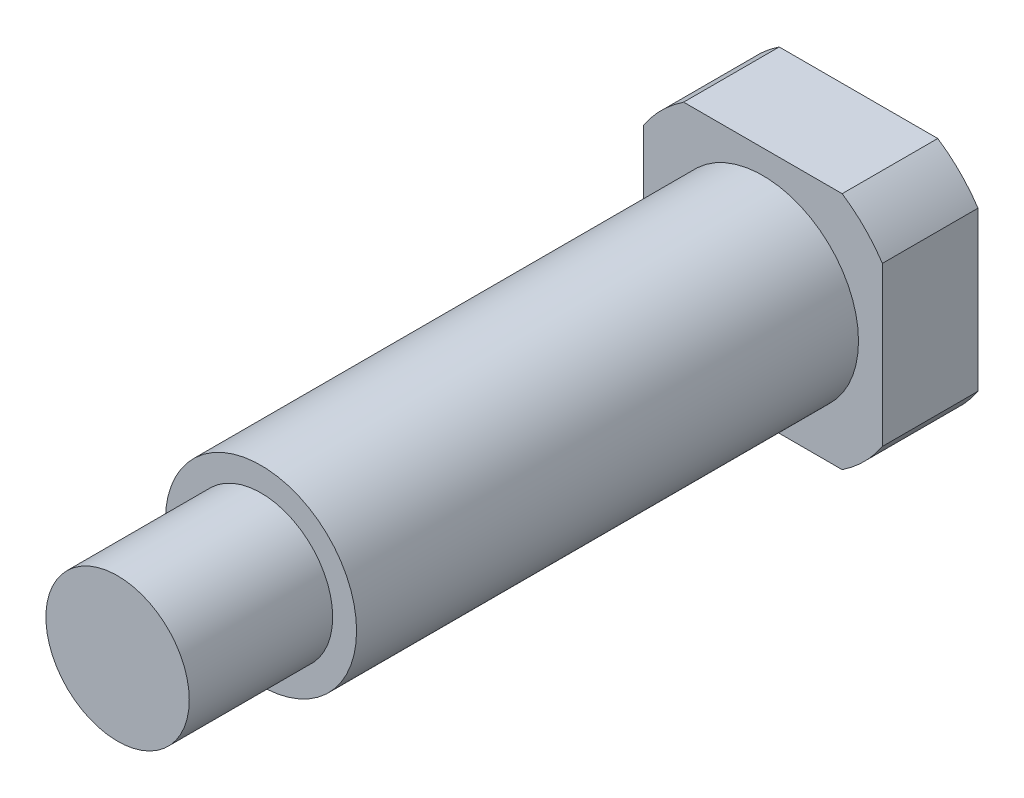
ISO-10303-21;
HEADER;
FILE_DESCRIPTION(('STEP AP214'),'2;1');
FILE_NAME('part.step','',(''),(''),'','','');
FILE_SCHEMA(('AUTOMOTIVE_DESIGN { 1 0 10303 214 1 1 1 1 }'));
ENDSEC;
DATA;
#1=APPLICATION_CONTEXT('core data for automotive mechanical design processes');
#2=APPLICATION_PROTOCOL_DEFINITION('international standard','automotive_design',2000,#1);
#3=PRODUCT_CONTEXT('',#1,'mechanical');
#4=PRODUCT('Part','Part','',(#3));
#5=PRODUCT_RELATED_PRODUCT_CATEGORY('part','',(#4));
#6=PRODUCT_DEFINITION_FORMATION('','',#4);
#7=PRODUCT_DEFINITION_CONTEXT('part definition',#1,'design');
#8=PRODUCT_DEFINITION('design','',#6,#7);
#9=PRODUCT_DEFINITION_SHAPE('','',#8);
#10=(LENGTH_UNIT() NAMED_UNIT(*) SI_UNIT(.MILLI.,.METRE.));
#11=(NAMED_UNIT(*) PLANE_ANGLE_UNIT() SI_UNIT($,.RADIAN.));
#12=(NAMED_UNIT(*) SI_UNIT($,.STERADIAN.) SOLID_ANGLE_UNIT());
#13=UNCERTAINTY_MEASURE_WITH_UNIT(LENGTH_MEASURE(1.E-05),#10,'distance_accuracy_value','');
#14=(GEOMETRIC_REPRESENTATION_CONTEXT(3) GLOBAL_UNCERTAINTY_ASSIGNED_CONTEXT((#13)) GLOBAL_UNIT_ASSIGNED_CONTEXT((#10,
#11,#12)) REPRESENTATION_CONTEXT('',''));
#15=CARTESIAN_POINT('',(0.,0.,0.));
#16=DIRECTION('',(0.,0.,1.));
#17=DIRECTION('',(1.,0.,0.));
#18=AXIS2_PLACEMENT_3D('',#15,#16,#17);
#19=CARTESIAN_POINT('',(0.,0.,4.));
#20=DIRECTION('',(0.,0.,1.));
#21=DIRECTION('',(1.,0.,0.));
#22=AXIS2_PLACEMENT_3D('',#19,#20,#21);
#23=PLANE('',#22);
#24=CARTESIAN_POINT('',(0.,0.,4.));
#25=DIRECTION('',(0.,0.,1.));
#26=DIRECTION('',(1.,0.,0.));
#27=AXIS2_PLACEMENT_3D('',#24,#25,#26);
#28=CIRCLE('',#27,4.);
#29=CARTESIAN_POINT('',(4.,0.,4.));
#30=VERTEX_POINT('',#29);
#31=EDGE_CURVE('E126',#30,#30,#28,.T.);
#32=ORIENTED_EDGE('',*,*,#31,.F.);
#33=EDGE_LOOP('',(#32));
#34=FACE_BOUND('',#33,.T.);
#35=CARTESIAN_POINT('',(0.,0.,4.));
#36=DIRECTION('',(0.,0.,1.));
#37=DIRECTION('',(1.,0.,0.));
#38=AXIS2_PLACEMENT_3D('',#35,#36,#37);
#39=CIRCLE('',#38,6.);
#40=CARTESIAN_POINT('',(3.3166247903554,-5.,4.));
#41=VERTEX_POINT('',#40);
#42=CARTESIAN_POINT('',(5.,-3.31662479035539,4.));
#43=VERTEX_POINT('',#42);
#44=EDGE_CURVE('E115',#41,#43,#39,.T.);
#45=ORIENTED_EDGE('',*,*,#44,.T.);
#46=DIRECTION('',(0.,1.,0.));
#47=VECTOR('',#46,1.);
#48=CARTESIAN_POINT('',(5.,0.,4.));
#49=LINE('',#48,#47);
#50=CARTESIAN_POINT('',(5.,3.31662479035539,4.));
#51=VERTEX_POINT('',#50);
#52=EDGE_CURVE('E158',#43,#51,#49,.T.);
#53=ORIENTED_EDGE('',*,*,#52,.T.);
#54=CARTESIAN_POINT('',(3.3166247903554,5.,4.));
#55=VERTEX_POINT('',#54);
#56=EDGE_CURVE('E108',#51,#55,#39,.T.);
#57=ORIENTED_EDGE('',*,*,#56,.T.);
#58=DIRECTION('',(-1.,0.,0.));
#59=VECTOR('',#58,1.);
#60=CARTESIAN_POINT('',(0.,5.,4.));
#61=LINE('',#60,#59);
#62=CARTESIAN_POINT('',(-3.3166247903554,5.,4.));
#63=VERTEX_POINT('',#62);
#64=EDGE_CURVE('E153',#55,#63,#61,.T.);
#65=ORIENTED_EDGE('',*,*,#64,.T.);
#66=CARTESIAN_POINT('',(-5.,3.3166247903554,4.));
#67=VERTEX_POINT('',#66);
#68=EDGE_CURVE('E173',#63,#67,#39,.T.);
#69=ORIENTED_EDGE('',*,*,#68,.T.);
#70=DIRECTION('',(0.,-1.,0.));
#71=VECTOR('',#70,1.);
#72=CARTESIAN_POINT('',(-5.,0.,4.));
#73=LINE('',#72,#71);
#74=CARTESIAN_POINT('',(-5.,-3.3166247903554,4.));
#75=VERTEX_POINT('',#74);
#76=EDGE_CURVE('E178',#67,#75,#73,.T.);
#77=ORIENTED_EDGE('',*,*,#76,.T.);
#78=CARTESIAN_POINT('',(-3.3166247903554,-5.,4.));
#79=VERTEX_POINT('',#78);
#80=EDGE_CURVE('E133',#75,#79,#39,.T.);
#81=ORIENTED_EDGE('',*,*,#80,.T.);
#82=DIRECTION('',(1.,0.,0.));
#83=VECTOR('',#82,1.);
#84=CARTESIAN_POINT('',(0.,-5.,4.));
#85=LINE('',#84,#83);
#86=EDGE_CURVE('E116',#79,#41,#85,.T.);
#87=ORIENTED_EDGE('',*,*,#86,.T.);
#88=EDGE_LOOP('',(#45,#53,#57,#65,#69,#77,#81,#87));
#89=FACE_BOUND('',#88,.T.);
#90=ADVANCED_FACE('F37',(#34,#89),#23,.T.);
#91=CARTESIAN_POINT('',(0.,0.,4.));
#92=DIRECTION('',(0.,0.,-1.));
#93=DIRECTION('',(-1.,0.,0.));
#94=AXIS2_PLACEMENT_3D('',#91,#92,#93);
#95=CYLINDRICAL_SURFACE('',#94,6.);
#96=DIRECTION('',(0.,0.,-1.));
#97=VECTOR('',#96,1.);
#98=CARTESIAN_POINT('',(5.,-3.31662479035539,4.));
#99=LINE('',#98,#97);
#100=CARTESIAN_POINT('',(5.,-3.31662479035539,0.));
#101=VERTEX_POINT('',#100);
#102=EDGE_CURVE('E51',#43,#101,#99,.T.);
#103=ORIENTED_EDGE('',*,*,#102,.F.);
#104=ORIENTED_EDGE('',*,*,#44,.F.);
#105=DIRECTION('',(0.,0.,-1.));
#106=VECTOR('',#105,1.);
#107=CARTESIAN_POINT('',(3.3166247903554,-5.,4.));
#108=LINE('',#107,#106);
#109=CARTESIAN_POINT('',(3.3166247903554,-5.,0.));
#110=VERTEX_POINT('',#109);
#111=EDGE_CURVE('E101',#110,#41,#108,.F.);
#112=ORIENTED_EDGE('',*,*,#111,.F.);
#113=CARTESIAN_POINT('',(0.,0.,0.));
#114=DIRECTION('',(0.,0.,1.));
#115=DIRECTION('',(1.,0.,0.));
#116=AXIS2_PLACEMENT_3D('',#113,#114,#115);
#117=CIRCLE('',#116,6.);
#118=EDGE_CURVE('E113',#110,#101,#117,.T.);
#119=ORIENTED_EDGE('',*,*,#118,.T.);
#120=EDGE_LOOP('',(#103,#104,#112,#119));
#121=FACE_BOUND('',#120,.T.);
#122=ADVANCED_FACE('F39',(#121),#95,.T.);
#123=DIRECTION('',(0.,0.,-1.));
#124=VECTOR('',#123,1.);
#125=CARTESIAN_POINT('',(5.,3.31662479035539,4.));
#126=LINE('',#125,#124);
#127=CARTESIAN_POINT('',(5.,3.31662479035539,0.));
#128=VERTEX_POINT('',#127);
#129=EDGE_CURVE('E156',#128,#51,#126,.F.);
#130=ORIENTED_EDGE('',*,*,#129,.F.);
#131=CARTESIAN_POINT('',(3.3166247903554,5.,0.));
#132=VERTEX_POINT('',#131);
#133=EDGE_CURVE('E123',#128,#132,#117,.T.);
#134=ORIENTED_EDGE('',*,*,#133,.T.);
#135=DIRECTION('',(0.,0.,-1.));
#136=VECTOR('',#135,1.);
#137=CARTESIAN_POINT('',(3.3166247903554,5.,4.));
#138=LINE('',#137,#136);
#139=EDGE_CURVE('E152',#55,#132,#138,.T.);
#140=ORIENTED_EDGE('',*,*,#139,.F.);
#141=ORIENTED_EDGE('',*,*,#56,.F.);
#142=EDGE_LOOP('',(#130,#134,#140,#141));
#143=FACE_BOUND('',#142,.T.);
#144=ADVANCED_FACE('F204',(#143),#95,.T.);
#145=DIRECTION('',(0.,0.,-1.));
#146=VECTOR('',#145,1.);
#147=CARTESIAN_POINT('',(-3.3166247903554,5.,4.));
#148=LINE('',#147,#146);
#149=CARTESIAN_POINT('',(-3.3166247903554,5.,0.));
#150=VERTEX_POINT('',#149);
#151=EDGE_CURVE('E143',#150,#63,#148,.F.);
#152=ORIENTED_EDGE('',*,*,#151,.F.);
#153=CARTESIAN_POINT('',(-5.,3.3166247903554,0.));
#154=VERTEX_POINT('',#153);
#155=EDGE_CURVE('E124',#150,#154,#117,.T.);
#156=ORIENTED_EDGE('',*,*,#155,.T.);
#157=DIRECTION('',(0.,0.,-1.));
#158=VECTOR('',#157,1.);
#159=CARTESIAN_POINT('',(-5.,3.3166247903554,4.));
#160=LINE('',#159,#158);
#161=EDGE_CURVE('E141',#67,#154,#160,.T.);
#162=ORIENTED_EDGE('',*,*,#161,.F.);
#163=ORIENTED_EDGE('',*,*,#68,.F.);
#164=EDGE_LOOP('',(#152,#156,#162,#163));
#165=FACE_BOUND('',#164,.T.);
#166=ADVANCED_FACE('F139',(#165),#95,.T.);
#167=DIRECTION('',(0.,0.,-1.));
#168=VECTOR('',#167,1.);
#169=CARTESIAN_POINT('',(-5.,-3.3166247903554,4.));
#170=LINE('',#169,#168);
#171=CARTESIAN_POINT('',(-5.,-3.3166247903554,0.));
#172=VERTEX_POINT('',#171);
#173=EDGE_CURVE('E181',#172,#75,#170,.F.);
#174=ORIENTED_EDGE('',*,*,#173,.F.);
#175=CARTESIAN_POINT('',(-3.3166247903554,-5.,0.));
#176=VERTEX_POINT('',#175);
#177=EDGE_CURVE('E120',#172,#176,#117,.T.);
#178=ORIENTED_EDGE('',*,*,#177,.T.);
#179=DIRECTION('',(0.,0.,-1.));
#180=VECTOR('',#179,1.);
#181=CARTESIAN_POINT('',(-3.3166247903554,-5.,4.));
#182=LINE('',#181,#180);
#183=EDGE_CURVE('E59',#79,#176,#182,.T.);
#184=ORIENTED_EDGE('',*,*,#183,.F.);
#185=ORIENTED_EDGE('',*,*,#80,.F.);
#186=EDGE_LOOP('',(#174,#178,#184,#185));
#187=FACE_BOUND('',#186,.T.);
#188=ADVANCED_FACE('F180',(#187),#95,.T.);
#189=CARTESIAN_POINT('',(0.,0.,0.));
#190=DIRECTION('',(0.,0.,1.));
#191=DIRECTION('',(1.,0.,0.));
#192=AXIS2_PLACEMENT_3D('',#189,#190,#191);
#193=PLANE('',#192);
#194=DIRECTION('',(0.,1.,0.));
#195=VECTOR('',#194,1.);
#196=CARTESIAN_POINT('',(5.,0.,0.));
#197=LINE('',#196,#195);
#198=EDGE_CURVE('E11',#101,#128,#197,.T.);
#199=ORIENTED_EDGE('',*,*,#198,.F.);
#200=ORIENTED_EDGE('',*,*,#118,.F.);
#201=DIRECTION('',(1.,0.,0.));
#202=VECTOR('',#201,1.);
#203=CARTESIAN_POINT('',(0.,-5.,0.));
#204=LINE('',#203,#202);
#205=EDGE_CURVE('E98',#176,#110,#204,.T.);
#206=ORIENTED_EDGE('',*,*,#205,.F.);
#207=ORIENTED_EDGE('',*,*,#177,.F.);
#208=DIRECTION('',(0.,-1.,0.));
#209=VECTOR('',#208,1.);
#210=CARTESIAN_POINT('',(-5.,0.,0.));
#211=LINE('',#210,#209);
#212=EDGE_CURVE('E107',#154,#172,#211,.T.);
#213=ORIENTED_EDGE('',*,*,#212,.F.);
#214=ORIENTED_EDGE('',*,*,#155,.F.);
#215=DIRECTION('',(-1.,0.,0.));
#216=VECTOR('',#215,1.);
#217=CARTESIAN_POINT('',(0.,5.,0.));
#218=LINE('',#217,#216);
#219=EDGE_CURVE('E45',#132,#150,#218,.T.);
#220=ORIENTED_EDGE('',*,*,#219,.F.);
#221=ORIENTED_EDGE('',*,*,#133,.F.);
#222=EDGE_LOOP('',(#199,#200,#206,#207,#213,#214,#220,#221));
#223=FACE_BOUND('',#222,.T.);
#224=ADVANCED_FACE('F118',(#223),#193,.F.);
#225=CARTESIAN_POINT('',(0.,0.,25.));
#226=DIRECTION('',(0.,0.,-1.));
#227=DIRECTION('',(-1.,0.,0.));
#228=AXIS2_PLACEMENT_3D('',#225,#226,#227);
#229=CYLINDRICAL_SURFACE('',#228,4.);
#230=CARTESIAN_POINT('',(0.,0.,25.));
#231=DIRECTION('',(0.,0.,1.));
#232=DIRECTION('',(1.,0.,0.));
#233=AXIS2_PLACEMENT_3D('',#230,#231,#232);
#234=CIRCLE('',#233,4.);
#235=CARTESIAN_POINT('',(4.,0.,25.));
#236=VERTEX_POINT('',#235);
#237=EDGE_CURVE('E121',#236,#236,#234,.T.);
#238=ORIENTED_EDGE('',*,*,#237,.F.);
#239=EDGE_LOOP('',(#238));
#240=FACE_BOUND('',#239,.T.);
#241=ORIENTED_EDGE('',*,*,#31,.T.);
#242=EDGE_LOOP('',(#241));
#243=FACE_BOUND('',#242,.T.);
#244=ADVANCED_FACE('F207',(#240,#243),#229,.T.);
#245=CARTESIAN_POINT('',(0.,0.,25.));
#246=DIRECTION('',(0.,0.,1.));
#247=DIRECTION('',(1.,0.,0.));
#248=AXIS2_PLACEMENT_3D('',#245,#246,#247);
#249=PLANE('',#248);
#250=CARTESIAN_POINT('',(0.,0.,25.));
#251=DIRECTION('',(0.,0.,1.));
#252=DIRECTION('',(1.,0.,0.));
#253=AXIS2_PLACEMENT_3D('',#250,#251,#252);
#254=CIRCLE('',#253,3.);
#255=CARTESIAN_POINT('',(3.,0.,25.));
#256=VERTEX_POINT('',#255);
#257=EDGE_CURVE('E166',#256,#256,#254,.T.);
#258=ORIENTED_EDGE('',*,*,#257,.F.);
#259=EDGE_LOOP('',(#258));
#260=FACE_BOUND('',#259,.T.);
#261=ORIENTED_EDGE('',*,*,#237,.T.);
#262=EDGE_LOOP('',(#261));
#263=FACE_BOUND('',#262,.T.);
#264=ADVANCED_FACE('F214',(#260,#263),#249,.T.);
#265=CARTESIAN_POINT('',(0.,0.,31.));
#266=DIRECTION('',(0.,0.,-1.));
#267=DIRECTION('',(-1.,0.,0.));
#268=AXIS2_PLACEMENT_3D('',#265,#266,#267);
#269=CYLINDRICAL_SURFACE('',#268,3.);
#270=CARTESIAN_POINT('',(0.,0.,31.));
#271=DIRECTION('',(0.,0.,1.));
#272=DIRECTION('',(1.,0.,0.));
#273=AXIS2_PLACEMENT_3D('',#270,#271,#272);
#274=CIRCLE('',#273,3.);
#275=CARTESIAN_POINT('',(3.,0.,31.));
#276=VERTEX_POINT('',#275);
#277=EDGE_CURVE('E167',#276,#276,#274,.T.);
#278=ORIENTED_EDGE('',*,*,#277,.F.);
#279=EDGE_LOOP('',(#278));
#280=FACE_BOUND('',#279,.T.);
#281=ORIENTED_EDGE('',*,*,#257,.T.);
#282=EDGE_LOOP('',(#281));
#283=FACE_BOUND('',#282,.T.);
#284=ADVANCED_FACE('F231',(#280,#283),#269,.T.);
#285=CARTESIAN_POINT('',(0.,0.,31.));
#286=DIRECTION('',(0.,0.,1.));
#287=DIRECTION('',(1.,0.,0.));
#288=AXIS2_PLACEMENT_3D('',#285,#286,#287);
#289=PLANE('',#288);
#290=ORIENTED_EDGE('',*,*,#277,.T.);
#291=EDGE_LOOP('',(#290));
#292=FACE_BOUND('',#291,.T.);
#293=ADVANCED_FACE('F196',(#292),#289,.T.);
#294=CARTESIAN_POINT('',(-5.,-5.,6.));
#295=DIRECTION('',(0.,-1.,0.));
#296=DIRECTION('',(1.,0.,0.));
#297=AXIS2_PLACEMENT_3D('',#294,#295,#296);
#298=PLANE('',#297);
#299=ORIENTED_EDGE('',*,*,#183,.T.);
#300=ORIENTED_EDGE('',*,*,#205,.T.);
#301=ORIENTED_EDGE('',*,*,#111,.T.);
#302=ORIENTED_EDGE('',*,*,#86,.F.);
#303=EDGE_LOOP('',(#299,#300,#301,#302));
#304=FACE_BOUND('',#303,.T.);
#305=ADVANCED_FACE('F100',(#304),#298,.T.);
#306=CARTESIAN_POINT('',(-5.,5.,6.));
#307=DIRECTION('',(-1.,0.,0.));
#308=DIRECTION('',(0.,-1.,0.));
#309=AXIS2_PLACEMENT_3D('',#306,#307,#308);
#310=PLANE('',#309);
#311=ORIENTED_EDGE('',*,*,#161,.T.);
#312=ORIENTED_EDGE('',*,*,#212,.T.);
#313=ORIENTED_EDGE('',*,*,#173,.T.);
#314=ORIENTED_EDGE('',*,*,#76,.F.);
#315=EDGE_LOOP('',(#311,#312,#313,#314));
#316=FACE_BOUND('',#315,.T.);
#317=ADVANCED_FACE('F187',(#316),#310,.T.);
#318=CARTESIAN_POINT('',(-5.,5.,6.));
#319=DIRECTION('',(0.,1.,0.));
#320=DIRECTION('',(-1.,0.,0.));
#321=AXIS2_PLACEMENT_3D('',#318,#319,#320);
#322=PLANE('',#321);
#323=ORIENTED_EDGE('',*,*,#139,.T.);
#324=ORIENTED_EDGE('',*,*,#219,.T.);
#325=ORIENTED_EDGE('',*,*,#151,.T.);
#326=ORIENTED_EDGE('',*,*,#64,.F.);
#327=EDGE_LOOP('',(#323,#324,#325,#326));
#328=FACE_BOUND('',#327,.T.);
#329=ADVANCED_FACE('F150',(#328),#322,.T.);
#330=CARTESIAN_POINT('',(5.,5.,6.));
#331=DIRECTION('',(1.,0.,0.));
#332=DIRECTION('',(0.,1.,0.));
#333=AXIS2_PLACEMENT_3D('',#330,#331,#332);
#334=PLANE('',#333);
#335=ORIENTED_EDGE('',*,*,#102,.T.);
#336=ORIENTED_EDGE('',*,*,#198,.T.);
#337=ORIENTED_EDGE('',*,*,#129,.T.);
#338=ORIENTED_EDGE('',*,*,#52,.F.);
#339=EDGE_LOOP('',(#335,#336,#337,#338));
#340=FACE_BOUND('',#339,.T.);
#341=ADVANCED_FACE('F194',(#340),#334,.T.);
#342=CLOSED_SHELL('',(#90,#122,#144,#166,#188,#224,#244,#264,#284,#293,#305,#317,#329,#341));
#343=MANIFOLD_SOLID_BREP('B2',#342);
#344=ADVANCED_BREP_SHAPE_REPRESENTATION('',(#18,#343),#14);
#345=SHAPE_DEFINITION_REPRESENTATION(#9,#344);
ENDSEC;
END-ISO-10303-21;
